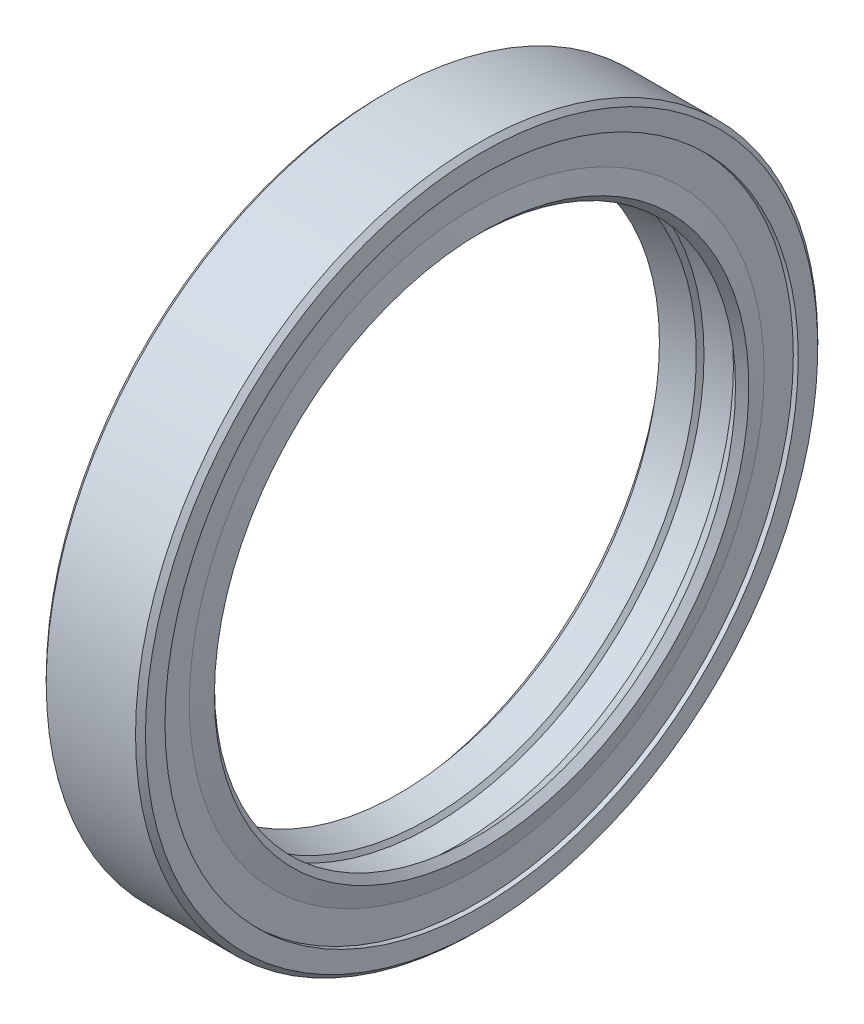
ISO-10303-21;
HEADER;
FILE_DESCRIPTION(('STEP AP214'),'2;1');
FILE_NAME('part.step','',(''),(''),'','','');
FILE_SCHEMA(('AUTOMOTIVE_DESIGN { 1 0 10303 214 1 1 1 1 }'));
ENDSEC;
DATA;
#1=APPLICATION_CONTEXT('core data for automotive mechanical design processes');
#2=APPLICATION_PROTOCOL_DEFINITION('international standard','automotive_design',2000,#1);
#3=PRODUCT_CONTEXT('',#1,'mechanical');
#4=PRODUCT('Part','Part','',(#3));
#5=PRODUCT_RELATED_PRODUCT_CATEGORY('part','',(#4));
#6=PRODUCT_DEFINITION_FORMATION('','',#4);
#7=PRODUCT_DEFINITION_CONTEXT('part definition',#1,'design');
#8=PRODUCT_DEFINITION('design','',#6,#7);
#9=PRODUCT_DEFINITION_SHAPE('','',#8);
#10=(LENGTH_UNIT() NAMED_UNIT(*) SI_UNIT(.MILLI.,.METRE.));
#11=(NAMED_UNIT(*) PLANE_ANGLE_UNIT() SI_UNIT($,.RADIAN.));
#12=(NAMED_UNIT(*) SI_UNIT($,.STERADIAN.) SOLID_ANGLE_UNIT());
#13=UNCERTAINTY_MEASURE_WITH_UNIT(LENGTH_MEASURE(1.E-05),#10,'distance_accuracy_value','');
#14=(GEOMETRIC_REPRESENTATION_CONTEXT(3) GLOBAL_UNCERTAINTY_ASSIGNED_CONTEXT((#13)) GLOBAL_UNIT_ASSIGNED_CONTEXT((#10,
#11,#12)) REPRESENTATION_CONTEXT('',''));
#15=CARTESIAN_POINT('',(0.,0.,0.));
#16=DIRECTION('',(0.,0.,1.));
#17=DIRECTION('',(1.,0.,0.));
#18=AXIS2_PLACEMENT_3D('',#15,#16,#17);
#19=CARTESIAN_POINT('',(-1.33333333333335,0.,0.));
#20=DIRECTION('',(-1.,0.,0.));
#21=DIRECTION('',(0.,0.,1.));
#22=AXIS2_PLACEMENT_3D('',#19,#20,#21);
#23=CONICAL_SURFACE('',#22,26.2,0.0676051492319799);
#24=CARTESIAN_POINT('',(3.46666666666667,0.,0.));
#25=DIRECTION('',(-1.,0.,0.));
#26=DIRECTION('',(0.,0.,1.));
#27=AXIS2_PLACEMENT_3D('',#24,#25,#26);
#28=CIRCLE('',#27,25.875);
#29=CARTESIAN_POINT('',(3.46666666666667,0.,25.875));
#30=VERTEX_POINT('',#29);
#31=EDGE_CURVE('E10',#30,#30,#28,.T.);
#32=ORIENTED_EDGE('',*,*,#31,.F.);
#33=EDGE_LOOP('',(#32));
#34=FACE_BOUND('',#33,.T.);
#35=CARTESIAN_POINT('',(-1.33333333333335,0.,0.));
#36=DIRECTION('',(-1.,0.,0.));
#37=DIRECTION('',(0.,0.,1.));
#38=AXIS2_PLACEMENT_3D('',#35,#36,#37);
#39=CIRCLE('',#38,26.2);
#40=CARTESIAN_POINT('',(-1.33333333333335,0.,26.2));
#41=VERTEX_POINT('',#40);
#42=EDGE_CURVE('E104',#41,#41,#39,.T.);
#43=ORIENTED_EDGE('',*,*,#42,.T.);
#44=EDGE_LOOP('',(#43));
#45=FACE_BOUND('',#44,.T.);
#46=ADVANCED_FACE('F14',(#34,#45),#23,.F.);
#47=CARTESIAN_POINT('',(3.46666666666667,25.8750000000001,0.));
#48=DIRECTION('',(1.,0.,0.));
#49=DIRECTION('',(0.,0.,-1.));
#50=AXIS2_PLACEMENT_3D('',#47,#48,#49);
#51=PLANE('',#50);
#52=CARTESIAN_POINT('',(3.46666666666667,0.,0.));
#53=DIRECTION('',(-1.,0.,0.));
#54=DIRECTION('',(0.,0.,1.));
#55=AXIS2_PLACEMENT_3D('',#52,#53,#54);
#56=CIRCLE('',#55,23.1666666666667);
#57=CARTESIAN_POINT('',(3.46666666666667,0.,23.1666666666667));
#58=VERTEX_POINT('',#57);
#59=EDGE_CURVE('E21',#58,#58,#56,.T.);
#60=ORIENTED_EDGE('',*,*,#59,.F.);
#61=EDGE_LOOP('',(#60));
#62=FACE_BOUND('',#61,.T.);
#63=ORIENTED_EDGE('',*,*,#31,.T.);
#64=EDGE_LOOP('',(#63));
#65=FACE_BOUND('',#64,.T.);
#66=ADVANCED_FACE('F123',(#62,#65),#51,.F.);
#67=CARTESIAN_POINT('',(3.46666666666667,0.,0.));
#68=DIRECTION('',(1.,0.,0.));
#69=DIRECTION('',(0.,0.,-1.));
#70=AXIS2_PLACEMENT_3D('',#67,#68,#69);
#71=CONICAL_SURFACE('',#70,23.1666666666667,0.191091918416454);
#72=CARTESIAN_POINT('',(1.64846409790459,0.,0.));
#73=DIRECTION('',(-1.,0.,0.));
#74=DIRECTION('',(0.,0.,1.));
#75=AXIS2_PLACEMENT_3D('',#72,#73,#74);
#76=CIRCLE('',#75,22.8149310506859);
#77=CARTESIAN_POINT('',(1.64846409790459,0.,22.8149310506859));
#78=VERTEX_POINT('',#77);
#79=EDGE_CURVE('E30',#78,#78,#76,.T.);
#80=ORIENTED_EDGE('',*,*,#79,.F.);
#81=EDGE_LOOP('',(#80));
#82=FACE_BOUND('',#81,.T.);
#83=ORIENTED_EDGE('',*,*,#59,.T.);
#84=EDGE_LOOP('',(#83));
#85=FACE_BOUND('',#84,.T.);
#86=ADVANCED_FACE('F128',(#82,#85),#71,.T.);
#87=CARTESIAN_POINT('',(0.666666666666649,0.,0.));
#88=DIRECTION('',(-1.,0.,0.));
#89=DIRECTION('',(0.,0.,1.));
#90=AXIS2_PLACEMENT_3D('',#87,#88,#89);
#91=TOROIDAL_SURFACE('',#90,22.625,1.);
#92=CARTESIAN_POINT('',(0.230776772312591,0.,0.));
#93=DIRECTION('',(-1.,0.,0.));
#94=DIRECTION('',(0.,0.,1.));
#95=AXIS2_PLACEMENT_3D('',#92,#93,#94);
#96=CIRCLE('',#95,23.525);
#97=CARTESIAN_POINT('',(0.230776772312591,0.,23.525));
#98=VERTEX_POINT('',#97);
#99=EDGE_CURVE('E38',#98,#98,#96,.T.);
#100=ORIENTED_EDGE('',*,*,#99,.F.);
#101=EDGE_LOOP('',(#100));
#102=FACE_BOUND('',#101,.T.);
#103=ORIENTED_EDGE('',*,*,#79,.T.);
#104=EDGE_LOOP('',(#103));
#105=FACE_BOUND('',#104,.T.);
#106=ADVANCED_FACE('F133',(#102,#105),#91,.T.);
#107=CARTESIAN_POINT('',(0.,0.,0.));
#108=DIRECTION('',(-1.,0.,0.));
#109=DIRECTION('',(0.,0.,1.));
#110=AXIS2_PLACEMENT_3D('',#107,#108,#109);
#111=CYLINDRICAL_SURFACE('',#110,23.525);
#112=ORIENTED_EDGE('',*,*,#99,.T.);
#113=EDGE_LOOP('',(#112));
#114=FACE_BOUND('',#113,.T.);
#115=CARTESIAN_POINT('',(-0.800000000000023,0.,0.));
#116=DIRECTION('',(-1.,0.,0.));
#117=DIRECTION('',(0.,0.,1.));
#118=AXIS2_PLACEMENT_3D('',#115,#116,#117);
#119=CIRCLE('',#118,23.525);
#120=CARTESIAN_POINT('',(-0.800000000000023,0.,23.525));
#121=VERTEX_POINT('',#120);
#122=EDGE_CURVE('E44',#121,#121,#119,.T.);
#123=ORIENTED_EDGE('',*,*,#122,.F.);
#124=EDGE_LOOP('',(#123));
#125=FACE_BOUND('',#124,.T.);
#126=ADVANCED_FACE('F139',(#114,#125),#111,.T.);
#127=CARTESIAN_POINT('',(-0.800000000000023,21.9285714285717,0.));
#128=DIRECTION('',(-1.,0.,0.));
#129=DIRECTION('',(0.,0.,1.));
#130=AXIS2_PLACEMENT_3D('',#127,#128,#129);
#131=PLANE('',#130);
#132=ORIENTED_EDGE('',*,*,#122,.T.);
#133=EDGE_LOOP('',(#132));
#134=FACE_BOUND('',#133,.T.);
#135=CARTESIAN_POINT('',(-0.800000000000023,0.,0.));
#136=DIRECTION('',(-1.,0.,0.));
#137=DIRECTION('',(0.,0.,1.));
#138=AXIS2_PLACEMENT_3D('',#135,#136,#137);
#139=CIRCLE('',#138,21.9285714285714);
#140=CARTESIAN_POINT('',(-0.800000000000023,0.,21.9285714285715));
#141=VERTEX_POINT('',#140);
#142=EDGE_CURVE('E48',#141,#141,#139,.T.);
#143=ORIENTED_EDGE('',*,*,#142,.F.);
#144=EDGE_LOOP('',(#143));
#145=FACE_BOUND('',#144,.T.);
#146=ADVANCED_FACE('F143',(#134,#145),#131,.T.);
#147=CARTESIAN_POINT('',(0.,0.,0.));
#148=DIRECTION('',(-1.,0.,0.));
#149=DIRECTION('',(0.,0.,1.));
#150=AXIS2_PLACEMENT_3D('',#147,#148,#149);
#151=CONICAL_SURFACE('',#150,21.,0.85964161504903);
#152=ORIENTED_EDGE('',*,*,#142,.T.);
#153=EDGE_LOOP('',(#152));
#154=FACE_BOUND('',#153,.T.);
#155=CARTESIAN_POINT('',(0.,0.,0.));
#156=DIRECTION('',(-1.,0.,0.));
#157=DIRECTION('',(0.,0.,1.));
#158=AXIS2_PLACEMENT_3D('',#155,#156,#157);
#159=CIRCLE('',#158,21.);
#160=CARTESIAN_POINT('',(0.,0.,21.));
#161=VERTEX_POINT('',#160);
#162=EDGE_CURVE('E52',#161,#161,#159,.T.);
#163=ORIENTED_EDGE('',*,*,#162,.F.);
#164=EDGE_LOOP('',(#163));
#165=FACE_BOUND('',#164,.T.);
#166=ADVANCED_FACE('F147',(#154,#165),#151,.F.);
#167=CARTESIAN_POINT('',(2.40000000000001,0.,0.));
#168=DIRECTION('',(1.,0.,0.));
#169=DIRECTION('',(0.,0.,-1.));
#170=AXIS2_PLACEMENT_3D('',#167,#168,#169);
#171=CONICAL_SURFACE('',#170,21.5777777777778,0.236245260718438);
#172=ORIENTED_EDGE('',*,*,#162,.T.);
#173=EDGE_LOOP('',(#172));
#174=FACE_BOUND('',#173,.T.);
#175=CARTESIAN_POINT('',(2.40000000000001,0.,0.));
#176=DIRECTION('',(-1.,0.,0.));
#177=DIRECTION('',(0.,0.,1.));
#178=AXIS2_PLACEMENT_3D('',#175,#176,#177);
#179=CIRCLE('',#178,21.5777777777778);
#180=CARTESIAN_POINT('',(2.40000000000001,0.,21.5777777777778));
#181=VERTEX_POINT('',#180);
#182=EDGE_CURVE('E56',#181,#181,#179,.T.);
#183=ORIENTED_EDGE('',*,*,#182,.F.);
#184=EDGE_LOOP('',(#183));
#185=FACE_BOUND('',#184,.T.);
#186=ADVANCED_FACE('F151',(#174,#185),#171,.F.);
#187=CARTESIAN_POINT('',(2.66666666666665,0.,0.));
#188=DIRECTION('',(1.,0.,0.));
#189=DIRECTION('',(0.,0.,-1.));
#190=AXIS2_PLACEMENT_3D('',#187,#188,#189);
#191=CONICAL_SURFACE('',#190,21.9285714285714,0.920811159017041);
#192=ORIENTED_EDGE('',*,*,#182,.T.);
#193=EDGE_LOOP('',(#192));
#194=FACE_BOUND('',#193,.T.);
#195=CARTESIAN_POINT('',(2.66666666666665,0.,0.));
#196=DIRECTION('',(-1.,0.,0.));
#197=DIRECTION('',(0.,0.,1.));
#198=AXIS2_PLACEMENT_3D('',#195,#196,#197);
#199=CIRCLE('',#198,21.9285714285714);
#200=CARTESIAN_POINT('',(2.66666666666665,0.,21.9285714285715));
#201=VERTEX_POINT('',#200);
#202=EDGE_CURVE('E60',#201,#201,#199,.T.);
#203=ORIENTED_EDGE('',*,*,#202,.F.);
#204=EDGE_LOOP('',(#203));
#205=FACE_BOUND('',#204,.T.);
#206=ADVANCED_FACE('F155',(#194,#205),#191,.F.);
#207=CARTESIAN_POINT('',(2.66666666666665,0.,0.));
#208=DIRECTION('',(1.,0.,0.));
#209=DIRECTION('',(0.,0.,-1.));
#210=AXIS2_PLACEMENT_3D('',#207,#208,#209);
#211=CONICAL_SURFACE('',#210,21.9285714285714,0.183622326169279);
#212=CARTESIAN_POINT('',(4.66666666666665,0.,0.));
#213=DIRECTION('',(-1.,0.,0.));
#214=DIRECTION('',(0.,0.,1.));
#215=AXIS2_PLACEMENT_3D('',#212,#213,#214);
#216=CIRCLE('',#215,22.3);
#217=CARTESIAN_POINT('',(4.66666666666665,0.,22.3));
#218=VERTEX_POINT('',#217);
#219=EDGE_CURVE('E64',#218,#218,#216,.T.);
#220=ORIENTED_EDGE('',*,*,#219,.F.);
#221=EDGE_LOOP('',(#220));
#222=FACE_BOUND('',#221,.T.);
#223=ORIENTED_EDGE('',*,*,#202,.T.);
#224=EDGE_LOOP('',(#223));
#225=FACE_BOUND('',#224,.T.);
#226=ADVANCED_FACE('F159',(#222,#225),#211,.F.);
#227=CARTESIAN_POINT('',(4.66666666666665,0.,0.));
#228=DIRECTION('',(-1.,0.,0.));
#229=DIRECTION('',(0.,0.,1.));
#230=AXIS2_PLACEMENT_3D('',#227,#228,#229);
#231=CONICAL_SURFACE('',#230,22.3,0.725229912242439);
#232=CARTESIAN_POINT('',(6.13333333333332,0.,0.));
#233=DIRECTION('',(-1.,0.,0.));
#234=DIRECTION('',(0.,0.,1.));
#235=AXIS2_PLACEMENT_3D('',#232,#233,#234);
#236=CIRCLE('',#235,21.);
#237=CARTESIAN_POINT('',(6.13333333333332,0.,21.));
#238=VERTEX_POINT('',#237);
#239=EDGE_CURVE('E68',#238,#238,#236,.T.);
#240=ORIENTED_EDGE('',*,*,#239,.F.);
#241=EDGE_LOOP('',(#240));
#242=FACE_BOUND('',#241,.T.);
#243=ORIENTED_EDGE('',*,*,#219,.T.);
#244=EDGE_LOOP('',(#243));
#245=FACE_BOUND('',#244,.T.);
#246=ADVANCED_FACE('F163',(#242,#245),#231,.F.);
#247=CARTESIAN_POINT('',(6.13333333333332,0.,0.));
#248=DIRECTION('',(1.,0.,0.));
#249=DIRECTION('',(0.,0.,-1.));
#250=AXIS2_PLACEMENT_3D('',#247,#248,#249);
#251=CONICAL_SURFACE('',#250,21.,0.793149946109655);
#252=CARTESIAN_POINT('',(6.66666666666665,0.,0.));
#253=DIRECTION('',(-1.,0.,0.));
#254=DIRECTION('',(0.,0.,1.));
#255=AXIS2_PLACEMENT_3D('',#252,#253,#254);
#256=CIRCLE('',#255,21.5416666666667);
#257=CARTESIAN_POINT('',(6.66666666666665,0.,21.5416666666667));
#258=VERTEX_POINT('',#257);
#259=EDGE_CURVE('E72',#258,#258,#256,.T.);
#260=ORIENTED_EDGE('',*,*,#259,.F.);
#261=EDGE_LOOP('',(#260));
#262=FACE_BOUND('',#261,.T.);
#263=ORIENTED_EDGE('',*,*,#239,.T.);
#264=EDGE_LOOP('',(#263));
#265=FACE_BOUND('',#264,.T.);
#266=ADVANCED_FACE('F167',(#262,#265),#251,.F.);
#267=CARTESIAN_POINT('',(6.66666666666665,0.,0.));
#268=DIRECTION('',(-1.,0.,0.));
#269=DIRECTION('',(0.,0.,1.));
#270=AXIS2_PLACEMENT_3D('',#267,#268,#269);
#271=CONICAL_SURFACE('',#270,21.5416666666667,1.32944083621949);
#272=CARTESIAN_POINT('',(6.26666666666664,0.,0.));
#273=DIRECTION('',(-1.,0.,0.));
#274=DIRECTION('',(0.,0.,1.));
#275=AXIS2_PLACEMENT_3D('',#272,#273,#274);
#276=CIRCLE('',#275,23.1666666666667);
#277=CARTESIAN_POINT('',(6.26666666666664,0.,23.1666666666667));
#278=VERTEX_POINT('',#277);
#279=EDGE_CURVE('E76',#278,#278,#276,.T.);
#280=ORIENTED_EDGE('',*,*,#279,.F.);
#281=EDGE_LOOP('',(#280));
#282=FACE_BOUND('',#281,.T.);
#283=ORIENTED_EDGE('',*,*,#259,.T.);
#284=EDGE_LOOP('',(#283));
#285=FACE_BOUND('',#284,.T.);
#286=ADVANCED_FACE('F171',(#282,#285),#271,.T.);
#287=CARTESIAN_POINT('',(6.26666666666664,23.1666666666667,0.));
#288=DIRECTION('',(-1.,0.,0.));
#289=DIRECTION('',(0.,0.,1.));
#290=AXIS2_PLACEMENT_3D('',#287,#288,#289);
#291=PLANE('',#290);
#292=CARTESIAN_POINT('',(6.26666666666664,0.,0.));
#293=DIRECTION('',(-1.,0.,0.));
#294=DIRECTION('',(0.,0.,1.));
#295=AXIS2_PLACEMENT_3D('',#292,#293,#294);
#296=CIRCLE('',#295,25.5266666666667);
#297=CARTESIAN_POINT('',(6.26666666666664,0.,25.5266666666667));
#298=VERTEX_POINT('',#297);
#299=EDGE_CURVE('E80',#298,#298,#296,.T.);
#300=ORIENTED_EDGE('',*,*,#299,.F.);
#301=EDGE_LOOP('',(#300));
#302=FACE_BOUND('',#301,.T.);
#303=ORIENTED_EDGE('',*,*,#279,.T.);
#304=EDGE_LOOP('',(#303));
#305=FACE_BOUND('',#304,.T.);
#306=ADVANCED_FACE('F175',(#302,#305),#291,.F.);
#307=CARTESIAN_POINT('',(0.,0.,0.));
#308=DIRECTION('',(-1.,0.,0.));
#309=DIRECTION('',(0.,0.,1.));
#310=AXIS2_PLACEMENT_3D('',#307,#308,#309);
#311=CYLINDRICAL_SURFACE('',#310,25.5266666666667);
#312=CARTESIAN_POINT('',(6.66666666666665,0.,0.));
#313=DIRECTION('',(-1.,0.,0.));
#314=DIRECTION('',(0.,0.,1.));
#315=AXIS2_PLACEMENT_3D('',#312,#313,#314);
#316=CIRCLE('',#315,25.5266666666667);
#317=CARTESIAN_POINT('',(6.66666666666665,0.,25.5266666666667));
#318=VERTEX_POINT('',#317);
#319=EDGE_CURVE('E84',#318,#318,#316,.T.);
#320=ORIENTED_EDGE('',*,*,#319,.F.);
#321=EDGE_LOOP('',(#320));
#322=FACE_BOUND('',#321,.T.);
#323=ORIENTED_EDGE('',*,*,#299,.T.);
#324=EDGE_LOOP('',(#323));
#325=FACE_BOUND('',#324,.T.);
#326=ADVANCED_FACE('F179',(#322,#325),#311,.F.);
#327=CARTESIAN_POINT('',(6.66666666666665,27.1000000000001,0.));
#328=DIRECTION('',(1.,0.,0.));
#329=DIRECTION('',(0.,0.,-1.));
#330=AXIS2_PLACEMENT_3D('',#327,#328,#329);
#331=PLANE('',#330);
#332=ORIENTED_EDGE('',*,*,#319,.T.);
#333=EDGE_LOOP('',(#332));
#334=FACE_BOUND('',#333,.T.);
#335=CARTESIAN_POINT('',(6.66666666666665,0.,0.));
#336=DIRECTION('',(-1.,0.,0.));
#337=DIRECTION('',(0.,0.,1.));
#338=AXIS2_PLACEMENT_3D('',#335,#336,#337);
#339=CIRCLE('',#338,27.1);
#340=CARTESIAN_POINT('',(6.66666666666665,0.,27.1));
#341=VERTEX_POINT('',#340);
#342=EDGE_CURVE('E88',#341,#341,#339,.T.);
#343=ORIENTED_EDGE('',*,*,#342,.F.);
#344=EDGE_LOOP('',(#343));
#345=FACE_BOUND('',#344,.T.);
#346=ADVANCED_FACE('F183',(#334,#345),#331,.T.);
#347=CARTESIAN_POINT('',(6.26666666666664,0.,0.));
#348=DIRECTION('',(-1.,0.,0.));
#349=DIRECTION('',(0.,0.,1.));
#350=AXIS2_PLACEMENT_3D('',#347,#348,#349);
#351=CONICAL_SURFACE('',#350,27.5,0.785398163397448);
#352=ORIENTED_EDGE('',*,*,#342,.T.);
#353=EDGE_LOOP('',(#352));
#354=FACE_BOUND('',#353,.T.);
#355=CARTESIAN_POINT('',(6.26666666666664,0.,0.));
#356=DIRECTION('',(-1.,0.,0.));
#357=DIRECTION('',(0.,0.,1.));
#358=AXIS2_PLACEMENT_3D('',#355,#356,#357);
#359=CIRCLE('',#358,27.5);
#360=CARTESIAN_POINT('',(6.26666666666664,0.,27.5));
#361=VERTEX_POINT('',#360);
#362=EDGE_CURVE('E92',#361,#361,#359,.T.);
#363=ORIENTED_EDGE('',*,*,#362,.F.);
#364=EDGE_LOOP('',(#363));
#365=FACE_BOUND('',#364,.T.);
#366=ADVANCED_FACE('F187',(#354,#365),#351,.T.);
#367=CARTESIAN_POINT('',(0.,0.,0.));
#368=DIRECTION('',(-1.,0.,0.));
#369=DIRECTION('',(0.,0.,1.));
#370=AXIS2_PLACEMENT_3D('',#367,#368,#369);
#371=CYLINDRICAL_SURFACE('',#370,27.5);
#372=ORIENTED_EDGE('',*,*,#362,.T.);
#373=EDGE_LOOP('',(#372));
#374=FACE_BOUND('',#373,.T.);
#375=CARTESIAN_POINT('',(-0.933333333333342,0.,0.));
#376=DIRECTION('',(-1.,0.,0.));
#377=DIRECTION('',(0.,0.,1.));
#378=AXIS2_PLACEMENT_3D('',#375,#376,#377);
#379=CIRCLE('',#378,27.5);
#380=CARTESIAN_POINT('',(-0.933333333333341,0.,27.5));
#381=VERTEX_POINT('',#380);
#382=EDGE_CURVE('E96',#381,#381,#379,.T.);
#383=ORIENTED_EDGE('',*,*,#382,.F.);
#384=EDGE_LOOP('',(#383));
#385=FACE_BOUND('',#384,.T.);
#386=ADVANCED_FACE('F119',(#374,#385),#371,.T.);
#387=CARTESIAN_POINT('',(-1.33333333333335,0.,0.));
#388=DIRECTION('',(1.,0.,0.));
#389=DIRECTION('',(0.,0.,-1.));
#390=AXIS2_PLACEMENT_3D('',#387,#388,#389);
#391=CONICAL_SURFACE('',#390,27.1,0.785398163397449);
#392=ORIENTED_EDGE('',*,*,#382,.T.);
#393=EDGE_LOOP('',(#392));
#394=FACE_BOUND('',#393,.T.);
#395=CARTESIAN_POINT('',(-1.33333333333335,0.,0.));
#396=DIRECTION('',(-1.,0.,0.));
#397=DIRECTION('',(0.,0.,1.));
#398=AXIS2_PLACEMENT_3D('',#395,#396,#397);
#399=CIRCLE('',#398,27.1);
#400=CARTESIAN_POINT('',(-1.33333333333335,0.,27.1));
#401=VERTEX_POINT('',#400);
#402=EDGE_CURVE('E100',#401,#401,#399,.T.);
#403=ORIENTED_EDGE('',*,*,#402,.F.);
#404=EDGE_LOOP('',(#403));
#405=FACE_BOUND('',#404,.T.);
#406=ADVANCED_FACE('F112',(#394,#405),#391,.T.);
#407=CARTESIAN_POINT('',(-1.33333333333335,26.2,0.));
#408=DIRECTION('',(-1.,0.,0.));
#409=DIRECTION('',(0.,0.,1.));
#410=AXIS2_PLACEMENT_3D('',#407,#408,#409);
#411=PLANE('',#410);
#412=ORIENTED_EDGE('',*,*,#402,.T.);
#413=EDGE_LOOP('',(#412));
#414=FACE_BOUND('',#413,.T.);
#415=ORIENTED_EDGE('',*,*,#42,.F.);
#416=EDGE_LOOP('',(#415));
#417=FACE_BOUND('',#416,.T.);
#418=ADVANCED_FACE('F110',(#414,#417),#411,.T.);
#419=CLOSED_SHELL('',(#46,#66,#86,#106,#126,#146,#166,#186,#206,#226,#246,#266,#286,#306,#326,
#346,#366,#386,#406,#418));
#420=MANIFOLD_SOLID_BREP('B1',#419);
#421=ADVANCED_BREP_SHAPE_REPRESENTATION('',(#18,#420),#14);
#422=SHAPE_DEFINITION_REPRESENTATION(#9,#421);
ENDSEC;
END-ISO-10303-21;
